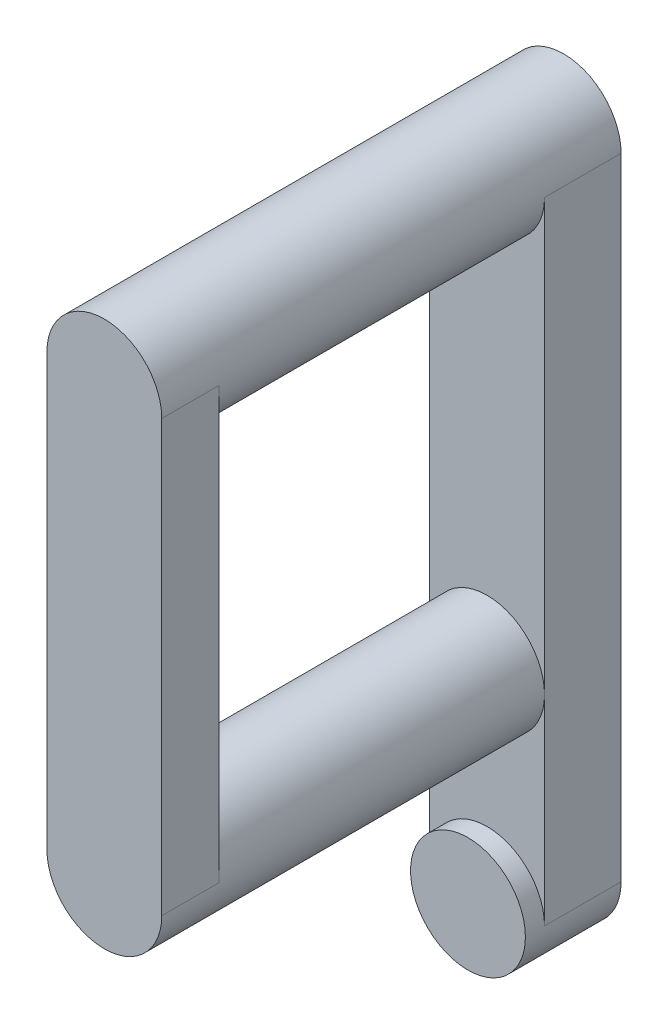
ISO-10303-21;
HEADER;
FILE_DESCRIPTION(('STEP AP214'),'2;1');
FILE_NAME('part.step','',(''),(''),'','','');
FILE_SCHEMA(('AUTOMOTIVE_DESIGN { 1 0 10303 214 1 1 1 1 }'));
ENDSEC;
DATA;
#1=APPLICATION_CONTEXT('core data for automotive mechanical design processes');
#2=APPLICATION_PROTOCOL_DEFINITION('international standard','automotive_design',2000,#1);
#3=PRODUCT_CONTEXT('',#1,'mechanical');
#4=PRODUCT('Part','Part','',(#3));
#5=PRODUCT_RELATED_PRODUCT_CATEGORY('part','',(#4));
#6=PRODUCT_DEFINITION_FORMATION('','',#4);
#7=PRODUCT_DEFINITION_CONTEXT('part definition',#1,'design');
#8=PRODUCT_DEFINITION('design','',#6,#7);
#9=PRODUCT_DEFINITION_SHAPE('','',#8);
#10=(LENGTH_UNIT() NAMED_UNIT(*) SI_UNIT(.MILLI.,.METRE.));
#11=(NAMED_UNIT(*) PLANE_ANGLE_UNIT() SI_UNIT($,.RADIAN.));
#12=(NAMED_UNIT(*) SI_UNIT($,.STERADIAN.) SOLID_ANGLE_UNIT());
#13=UNCERTAINTY_MEASURE_WITH_UNIT(LENGTH_MEASURE(1.E-05),#10,'distance_accuracy_value','');
#14=(GEOMETRIC_REPRESENTATION_CONTEXT(3) GLOBAL_UNCERTAINTY_ASSIGNED_CONTEXT((#13)) GLOBAL_UNIT_ASSIGNED_CONTEXT((#10,
#11,#12)) REPRESENTATION_CONTEXT('',''));
#15=CARTESIAN_POINT('',(0.,0.,0.));
#16=DIRECTION('',(0.,0.,1.));
#17=DIRECTION('',(1.,0.,0.));
#18=AXIS2_PLACEMENT_3D('',#15,#16,#17);
#19=CARTESIAN_POINT('',(40.5000000000002,-36.4438879489952,24.));
#20=DIRECTION('',(0.,0.,-1.));
#21=DIRECTION('',(-1.,0.,0.));
#22=AXIS2_PLACEMENT_3D('',#19,#20,#21);
#23=CYLINDRICAL_SURFACE('',#22,3.00000000000002);
#24=CARTESIAN_POINT('',(40.5000000000002,-36.4438879489952,4.));
#25=DIRECTION('',(0.,0.,1.));
#26=DIRECTION('',(-1.,0.,0.));
#27=AXIS2_PLACEMENT_3D('',#24,#25,#26);
#28=CIRCLE('',#27,3.00000000000002);
#29=CARTESIAN_POINT('',(37.5000000000001,-36.4438879489952,4.));
#30=VERTEX_POINT('',#29);
#31=CARTESIAN_POINT('',(43.5000000000002,-36.4438879489952,4.));
#32=VERTEX_POINT('',#31);
#33=EDGE_CURVE('E124',#30,#32,#28,.T.);
#34=ORIENTED_EDGE('',*,*,#33,.T.);
#35=CARTESIAN_POINT('',(40.5000000000002,-36.4438879489952,4.));
#36=DIRECTION('',(0.,0.,1.));
#37=DIRECTION('',(1.,0.,0.));
#38=AXIS2_PLACEMENT_3D('',#35,#36,#37);
#39=CIRCLE('',#38,3.00000000000002);
#40=EDGE_CURVE('E45',#30,#32,#39,.F.);
#41=ORIENTED_EDGE('',*,*,#40,.F.);
#42=EDGE_LOOP('',(#34,#41));
#43=FACE_BOUND('',#42,.T.);
#44=CARTESIAN_POINT('',(40.5000000000002,-36.4438879489952,21.));
#45=DIRECTION('',(0.,0.,1.));
#46=DIRECTION('',(1.,0.,0.));
#47=AXIS2_PLACEMENT_3D('',#44,#45,#46);
#48=CIRCLE('',#47,3.00000000000002);
#49=CARTESIAN_POINT('',(43.5000000000002,-36.4438879489952,21.));
#50=VERTEX_POINT('',#49);
#51=CARTESIAN_POINT('',(37.5000000000001,-36.4438879489952,21.));
#52=VERTEX_POINT('',#51);
#53=EDGE_CURVE('E11',#50,#52,#48,.T.);
#54=ORIENTED_EDGE('',*,*,#53,.F.);
#55=DIRECTION('',(0.,0.,1.));
#56=VECTOR('',#55,1.);
#57=CARTESIAN_POINT('',(43.5000000000002,-36.4438879489952,21.));
#58=LINE('',#57,#56);
#59=CARTESIAN_POINT('',(43.5000000000002,-36.4438879489952,24.));
#60=VERTEX_POINT('',#59);
#61=EDGE_CURVE('E227',#50,#60,#58,.T.);
#62=ORIENTED_EDGE('',*,*,#61,.T.);
#63=CARTESIAN_POINT('',(40.5000000000002,-36.4438879489952,24.));
#64=DIRECTION('',(0.,0.,1.));
#65=DIRECTION('',(-1.,0.,0.));
#66=AXIS2_PLACEMENT_3D('',#63,#64,#65);
#67=CIRCLE('',#66,3.00000000000002);
#68=CARTESIAN_POINT('',(37.5000000000001,-36.4438879489952,24.));
#69=VERTEX_POINT('',#68);
#70=EDGE_CURVE('E235',#69,#60,#67,.T.);
#71=ORIENTED_EDGE('',*,*,#70,.F.);
#72=DIRECTION('',(0.,0.,1.));
#73=VECTOR('',#72,1.);
#74=CARTESIAN_POINT('',(37.5000000000001,-36.4438879489952,21.));
#75=LINE('',#74,#73);
#76=EDGE_CURVE('E230',#52,#69,#75,.T.);
#77=ORIENTED_EDGE('',*,*,#76,.F.);
#78=EDGE_LOOP('',(#54,#62,#71,#77));
#79=FACE_BOUND('',#78,.T.);
#80=ADVANCED_FACE('F37',(#43,#79),#23,.T.);
#81=CARTESIAN_POINT('',(40.5000000000002,-13.9438879489952,4.));
#82=DIRECTION('',(0.,0.,1.));
#83=DIRECTION('',(1.,0.,0.));
#84=AXIS2_PLACEMENT_3D('',#81,#82,#83);
#85=PLANE('',#84);
#86=DIRECTION('',(0.,-1.,0.));
#87=VECTOR('',#86,1.);
#88=CARTESIAN_POINT('',(37.5000000000001,-13.9438879489952,4.));
#89=LINE('',#88,#87);
#90=CARTESIAN_POINT('',(37.5000000000001,-46.9087174614682,4.));
#91=VERTEX_POINT('',#90);
#92=EDGE_CURVE('E122',#30,#91,#89,.T.);
#93=ORIENTED_EDGE('',*,*,#92,.T.);
#94=CARTESIAN_POINT('',(40.5000000000002,-46.9087174614682,4.));
#95=DIRECTION('',(0.,0.,1.));
#96=DIRECTION('',(1.,0.,0.));
#97=AXIS2_PLACEMENT_3D('',#94,#95,#96);
#98=CIRCLE('',#97,3.00000000000003);
#99=CARTESIAN_POINT('',(43.5000000000002,-46.9087174614682,4.));
#100=VERTEX_POINT('',#99);
#101=EDGE_CURVE('E106',#91,#100,#98,.F.);
#102=ORIENTED_EDGE('',*,*,#101,.T.);
#103=DIRECTION('',(0.,1.,0.));
#104=VECTOR('',#103,1.);
#105=CARTESIAN_POINT('',(43.5000000000002,-13.9438879489952,4.));
#106=LINE('',#105,#104);
#107=EDGE_CURVE('E154',#100,#32,#106,.T.);
#108=ORIENTED_EDGE('',*,*,#107,.T.);
#109=ORIENTED_EDGE('',*,*,#33,.F.);
#110=EDGE_LOOP('',(#93,#102,#108,#109));
#111=FACE_BOUND('',#110,.T.);
#112=ADVANCED_FACE('F123',(#111),#85,.T.);
#113=CARTESIAN_POINT('',(40.5000000000002,-13.9438879489952,4.));
#114=DIRECTION('',(0.,0.,-1.));
#115=DIRECTION('',(-1.,0.,0.));
#116=AXIS2_PLACEMENT_3D('',#113,#114,#115);
#117=CYLINDRICAL_SURFACE('',#116,3.00000000000002);
#118=CARTESIAN_POINT('',(40.5000000000002,-13.9438879489952,24.));
#119=DIRECTION('',(0.,0.,1.));
#120=DIRECTION('',(1.,0.,0.));
#121=AXIS2_PLACEMENT_3D('',#118,#119,#120);
#122=CIRCLE('',#121,3.00000000000002);
#123=CARTESIAN_POINT('',(43.5000000000002,-13.9438879489952,24.));
#124=VERTEX_POINT('',#123);
#125=CARTESIAN_POINT('',(37.5000000000001,-13.9438879489952,24.));
#126=VERTEX_POINT('',#125);
#127=EDGE_CURVE('E150',#124,#126,#122,.T.);
#128=ORIENTED_EDGE('',*,*,#127,.F.);
#129=DIRECTION('',(0.,0.,1.));
#130=VECTOR('',#129,1.);
#131=CARTESIAN_POINT('',(43.5000000000002,-13.9438879489952,21.));
#132=LINE('',#131,#130);
#133=CARTESIAN_POINT('',(43.5000000000002,-13.9438879489952,21.));
#134=VERTEX_POINT('',#133);
#135=EDGE_CURVE('E224',#134,#124,#132,.T.);
#136=ORIENTED_EDGE('',*,*,#135,.F.);
#137=CARTESIAN_POINT('',(40.5000000000002,-13.9438879489952,21.));
#138=DIRECTION('',(0.,0.,1.));
#139=DIRECTION('',(1.,0.,0.));
#140=AXIS2_PLACEMENT_3D('',#137,#138,#139);
#141=CIRCLE('',#140,3.00000000000002);
#142=CARTESIAN_POINT('',(37.5000000000001,-13.9438879489952,21.));
#143=VERTEX_POINT('',#142);
#144=EDGE_CURVE('E226',#143,#134,#141,.T.);
#145=ORIENTED_EDGE('',*,*,#144,.F.);
#146=DIRECTION('',(0.,0.,1.));
#147=VECTOR('',#146,1.);
#148=CARTESIAN_POINT('',(37.5000000000001,-13.9438879489952,21.));
#149=LINE('',#148,#147);
#150=EDGE_CURVE('E221',#143,#126,#149,.T.);
#151=ORIENTED_EDGE('',*,*,#150,.T.);
#152=EDGE_LOOP('',(#128,#136,#145,#151));
#153=FACE_BOUND('',#152,.T.);
#154=CARTESIAN_POINT('',(40.5000000000002,-13.9438879489952,0.));
#155=DIRECTION('',(0.,0.,1.));
#156=DIRECTION('',(1.,0.,0.));
#157=AXIS2_PLACEMENT_3D('',#154,#155,#156);
#158=CIRCLE('',#157,3.00000000000002);
#159=CARTESIAN_POINT('',(43.5000000000002,-13.9438879489952,0.));
#160=VERTEX_POINT('',#159);
#161=CARTESIAN_POINT('',(37.5000000000001,-13.9438879489952,0.));
#162=VERTEX_POINT('',#161);
#163=EDGE_CURVE('E156',#160,#162,#158,.T.);
#164=ORIENTED_EDGE('',*,*,#163,.T.);
#165=DIRECTION('',(0.,0.,-1.));
#166=VECTOR('',#165,1.);
#167=CARTESIAN_POINT('',(37.5000000000001,-13.9438879489952,4.));
#168=LINE('',#167,#166);
#169=CARTESIAN_POINT('',(37.5000000000001,-13.9438879489952,4.));
#170=VERTEX_POINT('',#169);
#171=EDGE_CURVE('E134',#170,#162,#168,.T.);
#172=ORIENTED_EDGE('',*,*,#171,.F.);
#173=CARTESIAN_POINT('',(40.5000000000002,-13.9438879489952,4.));
#174=DIRECTION('',(0.,0.,1.));
#175=DIRECTION('',(1.,0.,0.));
#176=AXIS2_PLACEMENT_3D('',#173,#174,#175);
#177=CIRCLE('',#176,3.00000000000002);
#178=CARTESIAN_POINT('',(43.5000000000002,-13.9438879489952,4.));
#179=VERTEX_POINT('',#178);
#180=EDGE_CURVE('E136',#170,#179,#177,.T.);
#181=ORIENTED_EDGE('',*,*,#180,.T.);
#182=DIRECTION('',(0.,0.,-1.));
#183=VECTOR('',#182,1.);
#184=CARTESIAN_POINT('',(43.5000000000002,-13.9438879489952,4.));
#185=LINE('',#184,#183);
#186=EDGE_CURVE('E138',#179,#160,#185,.T.);
#187=ORIENTED_EDGE('',*,*,#186,.T.);
#188=EDGE_LOOP('',(#164,#172,#181,#187));
#189=FACE_BOUND('',#188,.T.);
#190=ADVANCED_FACE('F39',(#153,#189),#117,.T.);
#191=CARTESIAN_POINT('',(37.5000000000001,-13.9438879489952,4.));
#192=DIRECTION('',(1.,0.,0.));
#193=DIRECTION('',(0.,1.,0.));
#194=AXIS2_PLACEMENT_3D('',#191,#192,#193);
#195=PLANE('',#194);
#196=DIRECTION('',(0.,-1.,0.));
#197=VECTOR('',#196,1.);
#198=CARTESIAN_POINT('',(37.5000000000001,-13.9438879489952,0.));
#199=LINE('',#198,#197);
#200=CARTESIAN_POINT('',(37.5000000000002,-46.9087174614682,0.));
#201=VERTEX_POINT('',#200);
#202=EDGE_CURVE('E133',#162,#201,#199,.T.);
#203=ORIENTED_EDGE('',*,*,#202,.T.);
#204=DIRECTION('',(0.,0.,-1.));
#205=VECTOR('',#204,1.);
#206=CARTESIAN_POINT('',(37.5000000000002,-46.9087174614682,4.));
#207=LINE('',#206,#205);
#208=EDGE_CURVE('E111',#91,#201,#207,.T.);
#209=ORIENTED_EDGE('',*,*,#208,.F.);
#210=ORIENTED_EDGE('',*,*,#92,.F.);
#211=EDGE_CURVE('E128',#170,#30,#89,.T.);
#212=ORIENTED_EDGE('',*,*,#211,.F.);
#213=ORIENTED_EDGE('',*,*,#171,.T.);
#214=EDGE_LOOP('',(#203,#209,#210,#212,#213));
#215=FACE_BOUND('',#214,.T.);
#216=ADVANCED_FACE('F131',(#215),#195,.F.);
#217=CARTESIAN_POINT('',(40.5000000000002,-46.9087174614682,4.));
#218=DIRECTION('',(0.,0.,-1.));
#219=DIRECTION('',(-1.,0.,0.));
#220=AXIS2_PLACEMENT_3D('',#217,#218,#219);
#221=CYLINDRICAL_SURFACE('',#220,3.00000000000001);
#222=CARTESIAN_POINT('',(40.5000000000002,-46.9087174614682,0.));
#223=DIRECTION('',(0.,0.,1.));
#224=DIRECTION('',(1.,0.,0.));
#225=AXIS2_PLACEMENT_3D('',#222,#223,#224);
#226=CIRCLE('',#225,3.00000000000001);
#227=CARTESIAN_POINT('',(43.5000000000002,-46.9087174614682,0.));
#228=VERTEX_POINT('',#227);
#229=EDGE_CURVE('E160',#201,#228,#226,.T.);
#230=ORIENTED_EDGE('',*,*,#229,.T.);
#231=DIRECTION('',(0.,0.,-1.));
#232=VECTOR('',#231,1.);
#233=CARTESIAN_POINT('',(43.5000000000002,-46.9087174614682,4.));
#234=LINE('',#233,#232);
#235=EDGE_CURVE('E114',#100,#228,#234,.T.);
#236=ORIENTED_EDGE('',*,*,#235,.F.);
#237=ORIENTED_EDGE('',*,*,#101,.F.);
#238=ORIENTED_EDGE('',*,*,#208,.T.);
#239=EDGE_LOOP('',(#230,#236,#237,#238));
#240=FACE_BOUND('',#239,.T.);
#241=CARTESIAN_POINT('',(40.5000000000002,-46.9087174614682,5.));
#242=DIRECTION('',(0.,0.,1.));
#243=DIRECTION('',(1.,0.,0.));
#244=AXIS2_PLACEMENT_3D('',#241,#242,#243);
#245=CIRCLE('',#244,3.00000000000003);
#246=CARTESIAN_POINT('',(43.5000000000002,-46.9087174614682,5.));
#247=VERTEX_POINT('',#246);
#248=EDGE_CURVE('E118',#247,#247,#245,.T.);
#249=ORIENTED_EDGE('',*,*,#248,.F.);
#250=EDGE_LOOP('',(#249));
#251=FACE_BOUND('',#250,.T.);
#252=ADVANCED_FACE('F108',(#240,#251),#221,.T.);
#253=CARTESIAN_POINT('',(43.5000000000002,-13.9438879489952,4.));
#254=DIRECTION('',(-1.,0.,0.));
#255=DIRECTION('',(0.,-1.,0.));
#256=AXIS2_PLACEMENT_3D('',#253,#254,#255);
#257=PLANE('',#256);
#258=DIRECTION('',(0.,1.,0.));
#259=VECTOR('',#258,1.);
#260=CARTESIAN_POINT('',(43.5000000000002,-13.9438879489952,0.));
#261=LINE('',#260,#259);
#262=EDGE_CURVE('E129',#228,#160,#261,.T.);
#263=ORIENTED_EDGE('',*,*,#262,.T.);
#264=ORIENTED_EDGE('',*,*,#186,.F.);
#265=EDGE_CURVE('E153',#32,#179,#106,.T.);
#266=ORIENTED_EDGE('',*,*,#265,.F.);
#267=ORIENTED_EDGE('',*,*,#107,.F.);
#268=ORIENTED_EDGE('',*,*,#235,.T.);
#269=EDGE_LOOP('',(#263,#264,#266,#267,#268));
#270=FACE_BOUND('',#269,.T.);
#271=ADVANCED_FACE('F169',(#270),#257,.F.);
#272=ORIENTED_EDGE('',*,*,#211,.T.);
#273=ORIENTED_EDGE('',*,*,#40,.T.);
#274=ORIENTED_EDGE('',*,*,#265,.T.);
#275=ORIENTED_EDGE('',*,*,#180,.F.);
#276=EDGE_LOOP('',(#272,#273,#274,#275));
#277=FACE_BOUND('',#276,.T.);
#278=ADVANCED_FACE('F168',(#277),#85,.T.);
#279=CARTESIAN_POINT('',(40.5000000000002,-13.9438879489952,0.));
#280=DIRECTION('',(0.,0.,1.));
#281=DIRECTION('',(1.,0.,0.));
#282=AXIS2_PLACEMENT_3D('',#279,#280,#281);
#283=PLANE('',#282);
#284=CARTESIAN_POINT('',(40.5000000000002,-13.9438879489952,0.));
#285=DIRECTION('',(0.,0.,-1.));
#286=DIRECTION('',(-1.,0.,0.));
#287=AXIS2_PLACEMENT_3D('',#284,#285,#286);
#288=CIRCLE('',#287,1.7);
#289=CARTESIAN_POINT('',(38.8000000000002,-13.9438879489952,0.));
#290=VERTEX_POINT('',#289);
#291=EDGE_CURVE('E200',#290,#290,#288,.T.);
#292=ORIENTED_EDGE('',*,*,#291,.F.);
#293=EDGE_LOOP('',(#292));
#294=FACE_BOUND('',#293,.T.);
#295=CARTESIAN_POINT('',(40.5000000000002,-46.9087174614682,0.));
#296=DIRECTION('',(0.,0.,-1.));
#297=DIRECTION('',(1.,0.,0.));
#298=AXIS2_PLACEMENT_3D('',#295,#296,#297);
#299=CIRCLE('',#298,1.7);
#300=CARTESIAN_POINT('',(42.2000000000002,-46.9087174614682,0.));
#301=VERTEX_POINT('',#300);
#302=EDGE_CURVE('E203',#301,#301,#299,.T.);
#303=ORIENTED_EDGE('',*,*,#302,.F.);
#304=EDGE_LOOP('',(#303));
#305=FACE_BOUND('',#304,.T.);
#306=ORIENTED_EDGE('',*,*,#262,.F.);
#307=ORIENTED_EDGE('',*,*,#229,.F.);
#308=ORIENTED_EDGE('',*,*,#202,.F.);
#309=ORIENTED_EDGE('',*,*,#163,.F.);
#310=EDGE_LOOP('',(#306,#307,#308,#309));
#311=FACE_BOUND('',#310,.T.);
#312=ADVANCED_FACE('F167',(#294,#305,#311),#283,.F.);
#313=CARTESIAN_POINT('',(40.5000000000002,-13.9438879489952,24.));
#314=DIRECTION('',(0.,0.,1.));
#315=DIRECTION('',(1.,0.,0.));
#316=AXIS2_PLACEMENT_3D('',#313,#314,#315);
#317=PLANE('',#316);
#318=ORIENTED_EDGE('',*,*,#127,.T.);
#319=DIRECTION('',(0.,-1.,0.));
#320=VECTOR('',#319,1.);
#321=CARTESIAN_POINT('',(37.5000000000001,-13.9438879489952,24.));
#322=LINE('',#321,#320);
#323=EDGE_CURVE('E57',#126,#69,#322,.T.);
#324=ORIENTED_EDGE('',*,*,#323,.T.);
#325=ORIENTED_EDGE('',*,*,#70,.T.);
#326=DIRECTION('',(0.,1.,0.));
#327=VECTOR('',#326,1.);
#328=CARTESIAN_POINT('',(43.5000000000002,-13.9438879489952,24.));
#329=LINE('',#328,#327);
#330=EDGE_CURVE('E52',#60,#124,#329,.T.);
#331=ORIENTED_EDGE('',*,*,#330,.T.);
#332=EDGE_LOOP('',(#318,#324,#325,#331));
#333=FACE_BOUND('',#332,.T.);
#334=ADVANCED_FACE('F190',(#333),#317,.T.);
#335=CARTESIAN_POINT('',(40.5000000000002,-13.9438879489952,21.));
#336=DIRECTION('',(0.,0.,1.));
#337=DIRECTION('',(1.,0.,0.));
#338=AXIS2_PLACEMENT_3D('',#335,#336,#337);
#339=PLANE('',#338);
#340=DIRECTION('',(0.,-1.,0.));
#341=VECTOR('',#340,1.);
#342=CARTESIAN_POINT('',(37.5000000000001,-13.9438879489952,21.));
#343=LINE('',#342,#341);
#344=EDGE_CURVE('E215',#143,#52,#343,.T.);
#345=ORIENTED_EDGE('',*,*,#344,.F.);
#346=ORIENTED_EDGE('',*,*,#144,.T.);
#347=DIRECTION('',(0.,1.,0.));
#348=VECTOR('',#347,1.);
#349=CARTESIAN_POINT('',(43.5000000000002,-13.9438879489952,21.));
#350=LINE('',#349,#348);
#351=EDGE_CURVE('E218',#50,#134,#350,.T.);
#352=ORIENTED_EDGE('',*,*,#351,.F.);
#353=ORIENTED_EDGE('',*,*,#53,.T.);
#354=EDGE_LOOP('',(#345,#346,#352,#353));
#355=FACE_BOUND('',#354,.T.);
#356=ADVANCED_FACE('F192',(#355),#339,.F.);
#357=CARTESIAN_POINT('',(43.5000000000002,-13.9438879489952,21.));
#358=DIRECTION('',(1.,0.,0.));
#359=DIRECTION('',(0.,1.,0.));
#360=AXIS2_PLACEMENT_3D('',#357,#358,#359);
#361=PLANE('',#360);
#362=ORIENTED_EDGE('',*,*,#330,.F.);
#363=ORIENTED_EDGE('',*,*,#61,.F.);
#364=ORIENTED_EDGE('',*,*,#351,.T.);
#365=ORIENTED_EDGE('',*,*,#135,.T.);
#366=EDGE_LOOP('',(#362,#363,#364,#365));
#367=FACE_BOUND('',#366,.T.);
#368=ADVANCED_FACE('F241',(#367),#361,.T.);
#369=CARTESIAN_POINT('',(37.5000000000001,-13.9438879489952,21.));
#370=DIRECTION('',(-1.,0.,0.));
#371=DIRECTION('',(0.,-1.,0.));
#372=AXIS2_PLACEMENT_3D('',#369,#370,#371);
#373=PLANE('',#372);
#374=ORIENTED_EDGE('',*,*,#323,.F.);
#375=ORIENTED_EDGE('',*,*,#150,.F.);
#376=ORIENTED_EDGE('',*,*,#344,.T.);
#377=ORIENTED_EDGE('',*,*,#76,.T.);
#378=EDGE_LOOP('',(#374,#375,#376,#377));
#379=FACE_BOUND('',#378,.T.);
#380=ADVANCED_FACE('F188',(#379),#373,.T.);
#381=CARTESIAN_POINT('',(40.5000000000002,-46.9087174614682,5.));
#382=DIRECTION('',(0.,0.,1.));
#383=DIRECTION('',(1.,0.,0.));
#384=AXIS2_PLACEMENT_3D('',#381,#382,#383);
#385=PLANE('',#384);
#386=ORIENTED_EDGE('',*,*,#248,.T.);
#387=EDGE_LOOP('',(#386));
#388=FACE_BOUND('',#387,.T.);
#389=ADVANCED_FACE('F250',(#388),#385,.T.);
#390=CARTESIAN_POINT('',(40.5000000000002,-46.9087174614682,4.));
#391=DIRECTION('',(0.,0.,-1.));
#392=DIRECTION('',(-1.,0.,0.));
#393=AXIS2_PLACEMENT_3D('',#390,#391,#392);
#394=CYLINDRICAL_SURFACE('',#393,1.7);
#395=CARTESIAN_POINT('',(40.5000000000002,-46.9087174614682,4.));
#396=DIRECTION('',(0.,0.,-1.));
#397=DIRECTION('',(1.,0.,0.));
#398=AXIS2_PLACEMENT_3D('',#395,#396,#397);
#399=CIRCLE('',#398,1.7);
#400=CARTESIAN_POINT('',(42.2000000000002,-46.9087174614682,4.));
#401=VERTEX_POINT('',#400);
#402=EDGE_CURVE('E205',#401,#401,#399,.T.);
#403=ORIENTED_EDGE('',*,*,#402,.F.);
#404=EDGE_LOOP('',(#403));
#405=FACE_BOUND('',#404,.T.);
#406=ORIENTED_EDGE('',*,*,#302,.T.);
#407=EDGE_LOOP('',(#406));
#408=FACE_BOUND('',#407,.T.);
#409=ADVANCED_FACE('F255',(#405,#408),#394,.F.);
#410=CARTESIAN_POINT('',(40.5000000000002,-46.9087174614682,4.));
#411=DIRECTION('',(0.,0.,1.));
#412=DIRECTION('',(1.,0.,0.));
#413=AXIS2_PLACEMENT_3D('',#410,#411,#412);
#414=PLANE('',#413);
#415=ORIENTED_EDGE('',*,*,#402,.T.);
#416=EDGE_LOOP('',(#415));
#417=FACE_BOUND('',#416,.T.);
#418=ADVANCED_FACE('F263',(#417),#414,.F.);
#419=CARTESIAN_POINT('',(40.5000000000002,-13.9438879489952,4.));
#420=DIRECTION('',(0.,0.,-1.));
#421=DIRECTION('',(-1.,0.,0.));
#422=AXIS2_PLACEMENT_3D('',#419,#420,#421);
#423=CYLINDRICAL_SURFACE('',#422,1.7);
#424=CARTESIAN_POINT('',(40.5000000000002,-13.9438879489952,4.));
#425=DIRECTION('',(0.,0.,-1.));
#426=DIRECTION('',(-1.,0.,0.));
#427=AXIS2_PLACEMENT_3D('',#424,#425,#426);
#428=CIRCLE('',#427,1.7);
#429=CARTESIAN_POINT('',(38.8000000000002,-13.9438879489952,4.));
#430=VERTEX_POINT('',#429);
#431=EDGE_CURVE('E207',#430,#430,#428,.T.);
#432=ORIENTED_EDGE('',*,*,#431,.F.);
#433=EDGE_LOOP('',(#432));
#434=FACE_BOUND('',#433,.T.);
#435=ORIENTED_EDGE('',*,*,#291,.T.);
#436=EDGE_LOOP('',(#435));
#437=FACE_BOUND('',#436,.T.);
#438=ADVANCED_FACE('F266',(#434,#437),#423,.F.);
#439=CARTESIAN_POINT('',(40.5000000000002,-13.9438879489952,4.));
#440=DIRECTION('',(0.,0.,-1.));
#441=DIRECTION('',(-1.,0.,0.));
#442=AXIS2_PLACEMENT_3D('',#439,#440,#441);
#443=PLANE('',#442);
#444=ORIENTED_EDGE('',*,*,#431,.T.);
#445=EDGE_LOOP('',(#444));
#446=FACE_BOUND('',#445,.T.);
#447=ADVANCED_FACE('F273',(#446),#443,.T.);
#448=CLOSED_SHELL('',(#80,#112,#190,#216,#252,#271,#278,#312,#334,#356,#368,#380,#389,#409,#418,
#438,#447));
#449=MANIFOLD_SOLID_BREP('B2',#448);
#450=ADVANCED_BREP_SHAPE_REPRESENTATION('',(#18,#449),#14);
#451=SHAPE_DEFINITION_REPRESENTATION(#9,#450);
ENDSEC;
END-ISO-10303-21;
